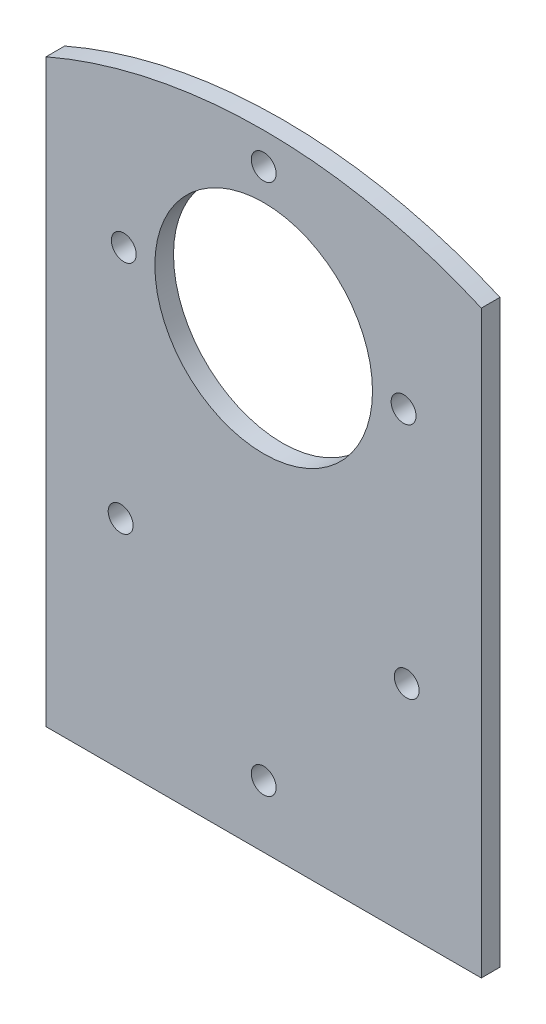
ISO-10303-21;
HEADER;
FILE_DESCRIPTION(('STEP AP214'),'2;1');
FILE_NAME('part.step','',(''),(''),'','','');
FILE_SCHEMA(('AUTOMOTIVE_DESIGN { 1 0 10303 214 1 1 1 1 }'));
ENDSEC;
DATA;
#1=APPLICATION_CONTEXT('core data for automotive mechanical design processes');
#2=APPLICATION_PROTOCOL_DEFINITION('international standard','automotive_design',2000,#1);
#3=PRODUCT_CONTEXT('',#1,'mechanical');
#4=PRODUCT('Part','Part','',(#3));
#5=PRODUCT_RELATED_PRODUCT_CATEGORY('part','',(#4));
#6=PRODUCT_DEFINITION_FORMATION('','',#4);
#7=PRODUCT_DEFINITION_CONTEXT('part definition',#1,'design');
#8=PRODUCT_DEFINITION('design','',#6,#7);
#9=PRODUCT_DEFINITION_SHAPE('','',#8);
#10=(LENGTH_UNIT() NAMED_UNIT(*) SI_UNIT(.MILLI.,.METRE.));
#11=(NAMED_UNIT(*) PLANE_ANGLE_UNIT() SI_UNIT($,.RADIAN.));
#12=(NAMED_UNIT(*) SI_UNIT($,.STERADIAN.) SOLID_ANGLE_UNIT());
#13=UNCERTAINTY_MEASURE_WITH_UNIT(LENGTH_MEASURE(1.E-05),#10,'distance_accuracy_value','');
#14=(GEOMETRIC_REPRESENTATION_CONTEXT(3) GLOBAL_UNCERTAINTY_ASSIGNED_CONTEXT((#13)) GLOBAL_UNIT_ASSIGNED_CONTEXT((#10,
#11,#12)) REPRESENTATION_CONTEXT('',''));
#15=CARTESIAN_POINT('',(0.,0.,0.));
#16=DIRECTION('',(0.,0.,1.));
#17=DIRECTION('',(1.,0.,0.));
#18=AXIS2_PLACEMENT_3D('',#15,#16,#17);
#19=CARTESIAN_POINT('',(-35.,-52.5,3.));
#20=DIRECTION('',(1.,0.,0.));
#21=DIRECTION('',(0.,0.,-1.));
#22=AXIS2_PLACEMENT_3D('',#19,#20,#21);
#23=PLANE('',#22);
#24=DIRECTION('',(0.,-1.,0.));
#25=VECTOR('',#24,1.);
#26=CARTESIAN_POINT('',(-35.,-52.5,3.));
#27=LINE('',#26,#25);
#28=CARTESIAN_POINT('',(-35.,40.7935435021813,3.));
#29=VERTEX_POINT('',#28);
#30=CARTESIAN_POINT('',(-35.,-52.5,3.));
#31=VERTEX_POINT('',#30);
#32=EDGE_CURVE('E88',#29,#31,#27,.T.);
#33=ORIENTED_EDGE('',*,*,#32,.F.);
#34=DIRECTION('',(0.,0.,1.));
#35=VECTOR('',#34,1.);
#36=CARTESIAN_POINT('',(-35.,40.7935435021813,-7.));
#37=LINE('',#36,#35);
#38=CARTESIAN_POINT('',(-35.,40.7935435021813,0.));
#39=VERTEX_POINT('',#38);
#40=EDGE_CURVE('E127',#39,#29,#37,.T.);
#41=ORIENTED_EDGE('',*,*,#40,.F.);
#42=DIRECTION('',(0.,-1.,0.));
#43=VECTOR('',#42,1.);
#44=CARTESIAN_POINT('',(-35.,-52.5,0.));
#45=LINE('',#44,#43);
#46=CARTESIAN_POINT('',(-35.,-52.5,0.));
#47=VERTEX_POINT('',#46);
#48=EDGE_CURVE('E80',#39,#47,#45,.T.);
#49=ORIENTED_EDGE('',*,*,#48,.T.);
#50=DIRECTION('',(0.,0.,-1.));
#51=VECTOR('',#50,1.);
#52=CARTESIAN_POINT('',(-35.,-52.5,3.));
#53=LINE('',#52,#51);
#54=EDGE_CURVE('E42',#31,#47,#53,.T.);
#55=ORIENTED_EDGE('',*,*,#54,.F.);
#56=EDGE_LOOP('',(#33,#41,#49,#55));
#57=FACE_BOUND('',#56,.T.);
#58=ADVANCED_FACE('F35',(#57),#23,.F.);
#59=CARTESIAN_POINT('',(35.,-52.5,3.));
#60=DIRECTION('',(0.,1.,0.));
#61=DIRECTION('',(-1.,0.,0.));
#62=AXIS2_PLACEMENT_3D('',#59,#60,#61);
#63=PLANE('',#62);
#64=DIRECTION('',(1.,0.,0.));
#65=VECTOR('',#64,1.);
#66=CARTESIAN_POINT('',(35.,-52.5,0.));
#67=LINE('',#66,#65);
#68=CARTESIAN_POINT('',(35.,-52.5,0.));
#69=VERTEX_POINT('',#68);
#70=EDGE_CURVE('E70',#47,#69,#67,.T.);
#71=ORIENTED_EDGE('',*,*,#70,.T.);
#72=DIRECTION('',(0.,0.,-1.));
#73=VECTOR('',#72,1.);
#74=CARTESIAN_POINT('',(35.,-52.5,3.));
#75=LINE('',#74,#73);
#76=CARTESIAN_POINT('',(35.,-52.5,3.));
#77=VERTEX_POINT('',#76);
#78=EDGE_CURVE('E73',#77,#69,#75,.T.);
#79=ORIENTED_EDGE('',*,*,#78,.F.);
#80=DIRECTION('',(1.,0.,0.));
#81=VECTOR('',#80,1.);
#82=CARTESIAN_POINT('',(35.,-52.5,3.));
#83=LINE('',#82,#81);
#84=EDGE_CURVE('E57',#31,#77,#83,.T.);
#85=ORIENTED_EDGE('',*,*,#84,.F.);
#86=ORIENTED_EDGE('',*,*,#54,.T.);
#87=EDGE_LOOP('',(#71,#79,#85,#86));
#88=FACE_BOUND('',#87,.T.);
#89=ADVANCED_FACE('F72',(#88),#63,.F.);
#90=CARTESIAN_POINT('',(35.,-52.5,3.));
#91=DIRECTION('',(-1.,0.,0.));
#92=DIRECTION('',(0.,0.,1.));
#93=AXIS2_PLACEMENT_3D('',#90,#91,#92);
#94=PLANE('',#93);
#95=DIRECTION('',(0.,1.,0.));
#96=VECTOR('',#95,1.);
#97=CARTESIAN_POINT('',(35.,-52.5,0.));
#98=LINE('',#97,#96);
#99=CARTESIAN_POINT('',(35.,40.7935435021813,0.));
#100=VERTEX_POINT('',#99);
#101=EDGE_CURVE('E79',#69,#100,#98,.T.);
#102=ORIENTED_EDGE('',*,*,#101,.T.);
#103=DIRECTION('',(0.,0.,1.));
#104=VECTOR('',#103,1.);
#105=CARTESIAN_POINT('',(35.,40.7935435021813,-7.));
#106=LINE('',#105,#104);
#107=CARTESIAN_POINT('',(35.,40.7935435021813,3.));
#108=VERTEX_POINT('',#107);
#109=EDGE_CURVE('E49',#100,#108,#106,.T.);
#110=ORIENTED_EDGE('',*,*,#109,.T.);
#111=DIRECTION('',(0.,1.,0.));
#112=VECTOR('',#111,1.);
#113=CARTESIAN_POINT('',(35.,-52.5,3.));
#114=LINE('',#113,#112);
#115=EDGE_CURVE('E85',#77,#108,#114,.T.);
#116=ORIENTED_EDGE('',*,*,#115,.F.);
#117=ORIENTED_EDGE('',*,*,#78,.T.);
#118=EDGE_LOOP('',(#102,#110,#116,#117));
#119=FACE_BOUND('',#118,.T.);
#120=ADVANCED_FACE('F84',(#119),#94,.F.);
#121=CARTESIAN_POINT('',(0.,0.,3.));
#122=DIRECTION('',(0.,0.,1.));
#123=DIRECTION('',(1.,0.,0.));
#124=AXIS2_PLACEMENT_3D('',#121,#122,#123);
#125=PLANE('',#124);
#126=CARTESIAN_POINT('',(0.,-39.6661412899121,3.));
#127=DIRECTION('',(0.,0.,-1.));
#128=DIRECTION('',(-1.,0.,0.));
#129=AXIS2_PLACEMENT_3D('',#126,#127,#128);
#130=CIRCLE('',#129,87.7425830303795);
#131=EDGE_CURVE('E133',#29,#108,#130,.T.);
#132=ORIENTED_EDGE('',*,*,#131,.F.);
#133=ORIENTED_EDGE('',*,*,#32,.T.);
#134=ORIENTED_EDGE('',*,*,#84,.T.);
#135=ORIENTED_EDGE('',*,*,#115,.T.);
#136=EDGE_LOOP('',(#132,#133,#134,#135));
#137=FACE_BOUND('',#136,.T.);
#138=CARTESIAN_POINT('',(0.,-42.5,3.));
#139=DIRECTION('',(0.,0.,1.));
#140=DIRECTION('',(1.,0.,0.));
#141=AXIS2_PLACEMENT_3D('',#138,#139,#140);
#142=CIRCLE('',#141,2.);
#143=CARTESIAN_POINT('',(2.00000000000002,-42.5,3.));
#144=VERTEX_POINT('',#143);
#145=EDGE_CURVE('E98',#144,#144,#142,.T.);
#146=ORIENTED_EDGE('',*,*,#145,.F.);
#147=EDGE_LOOP('',(#146));
#148=FACE_BOUND('',#147,.T.);
#149=CARTESIAN_POINT('',(-23.,-17.5,3.));
#150=DIRECTION('',(0.,0.,1.));
#151=DIRECTION('',(1.,0.,0.));
#152=AXIS2_PLACEMENT_3D('',#149,#150,#151);
#153=CIRCLE('',#152,2.00000000000001);
#154=CARTESIAN_POINT('',(-21.,-17.5,3.));
#155=VERTEX_POINT('',#154);
#156=EDGE_CURVE('E147',#155,#155,#153,.T.);
#157=ORIENTED_EDGE('',*,*,#156,.F.);
#158=EDGE_LOOP('',(#157));
#159=FACE_BOUND('',#158,.T.);
#160=CARTESIAN_POINT('',(23.,-17.5,3.));
#161=DIRECTION('',(0.,0.,1.));
#162=DIRECTION('',(-1.,0.,0.));
#163=AXIS2_PLACEMENT_3D('',#160,#161,#162);
#164=CIRCLE('',#163,2.00000000000001);
#165=CARTESIAN_POINT('',(21.,-17.5,3.));
#166=VERTEX_POINT('',#165);
#167=EDGE_CURVE('E151',#166,#166,#164,.T.);
#168=ORIENTED_EDGE('',*,*,#167,.F.);
#169=EDGE_LOOP('',(#168));
#170=FACE_BOUND('',#169,.T.);
#171=CARTESIAN_POINT('',(0.,43.,3.));
#172=DIRECTION('',(0.,0.,1.));
#173=DIRECTION('',(1.,0.,0.));
#174=AXIS2_PLACEMENT_3D('',#171,#172,#173);
#175=CIRCLE('',#174,2.);
#176=CARTESIAN_POINT('',(2.,43.,3.));
#177=VERTEX_POINT('',#176);
#178=EDGE_CURVE('E155',#177,#177,#175,.T.);
#179=ORIENTED_EDGE('',*,*,#178,.F.);
#180=EDGE_LOOP('',(#179));
#181=FACE_BOUND('',#180,.T.);
#182=CARTESIAN_POINT('',(-22.5,20.5,3.));
#183=DIRECTION('',(0.,0.,1.));
#184=DIRECTION('',(1.,0.,0.));
#185=AXIS2_PLACEMENT_3D('',#182,#183,#184);
#186=CIRCLE('',#185,2.);
#187=CARTESIAN_POINT('',(-20.5,20.5,3.));
#188=VERTEX_POINT('',#187);
#189=EDGE_CURVE('E159',#188,#188,#186,.T.);
#190=ORIENTED_EDGE('',*,*,#189,.F.);
#191=EDGE_LOOP('',(#190));
#192=FACE_BOUND('',#191,.T.);
#193=CARTESIAN_POINT('',(22.5,20.5,3.));
#194=DIRECTION('',(0.,0.,1.));
#195=DIRECTION('',(1.,0.,0.));
#196=AXIS2_PLACEMENT_3D('',#193,#194,#195);
#197=CIRCLE('',#196,2.);
#198=CARTESIAN_POINT('',(24.5,20.5,3.));
#199=VERTEX_POINT('',#198);
#200=EDGE_CURVE('E106',#199,#199,#197,.T.);
#201=ORIENTED_EDGE('',*,*,#200,.F.);
#202=EDGE_LOOP('',(#201));
#203=FACE_BOUND('',#202,.T.);
#204=CARTESIAN_POINT('',(0.,20.5,3.));
#205=DIRECTION('',(0.,0.,-1.));
#206=DIRECTION('',(-1.,0.,0.));
#207=AXIS2_PLACEMENT_3D('',#204,#205,#206);
#208=CIRCLE('',#207,17.5);
#209=CARTESIAN_POINT('',(-17.5,20.5,3.));
#210=VERTEX_POINT('',#209);
#211=EDGE_CURVE('E115',#210,#210,#208,.T.);
#212=ORIENTED_EDGE('',*,*,#211,.T.);
#213=EDGE_LOOP('',(#212));
#214=FACE_BOUND('',#213,.T.);
#215=ADVANCED_FACE('F137',(#137,#148,#159,#170,#181,#192,#203,#214),#125,.T.);
#216=CARTESIAN_POINT('',(0.,0.,0.));
#217=DIRECTION('',(0.,0.,1.));
#218=DIRECTION('',(1.,0.,0.));
#219=AXIS2_PLACEMENT_3D('',#216,#217,#218);
#220=PLANE('',#219);
#221=CARTESIAN_POINT('',(0.,-42.5,0.));
#222=DIRECTION('',(0.,0.,1.));
#223=DIRECTION('',(1.,0.,0.));
#224=AXIS2_PLACEMENT_3D('',#221,#222,#223);
#225=CIRCLE('',#224,2.);
#226=CARTESIAN_POINT('',(2.00000000000002,-42.5,0.));
#227=VERTEX_POINT('',#226);
#228=EDGE_CURVE('E100',#227,#227,#225,.T.);
#229=ORIENTED_EDGE('',*,*,#228,.T.);
#230=EDGE_LOOP('',(#229));
#231=FACE_BOUND('',#230,.T.);
#232=CARTESIAN_POINT('',(-23.,-17.5,0.));
#233=DIRECTION('',(0.,0.,1.));
#234=DIRECTION('',(1.,0.,0.));
#235=AXIS2_PLACEMENT_3D('',#232,#233,#234);
#236=CIRCLE('',#235,2.00000000000001);
#237=CARTESIAN_POINT('',(-21.,-17.5,0.));
#238=VERTEX_POINT('',#237);
#239=EDGE_CURVE('E97',#238,#238,#236,.T.);
#240=ORIENTED_EDGE('',*,*,#239,.T.);
#241=EDGE_LOOP('',(#240));
#242=FACE_BOUND('',#241,.T.);
#243=CARTESIAN_POINT('',(23.,-17.5,0.));
#244=DIRECTION('',(0.,0.,1.));
#245=DIRECTION('',(1.,0.,0.));
#246=AXIS2_PLACEMENT_3D('',#243,#244,#245);
#247=CIRCLE('',#246,2.00000000000001);
#248=CARTESIAN_POINT('',(25.,-17.5,0.));
#249=VERTEX_POINT('',#248);
#250=EDGE_CURVE('E94',#249,#249,#247,.T.);
#251=ORIENTED_EDGE('',*,*,#250,.T.);
#252=EDGE_LOOP('',(#251));
#253=FACE_BOUND('',#252,.T.);
#254=CARTESIAN_POINT('',(0.,43.,0.));
#255=DIRECTION('',(0.,0.,1.));
#256=DIRECTION('',(1.,0.,0.));
#257=AXIS2_PLACEMENT_3D('',#254,#255,#256);
#258=CIRCLE('',#257,2.);
#259=CARTESIAN_POINT('',(2.,43.,0.));
#260=VERTEX_POINT('',#259);
#261=EDGE_CURVE('E120',#260,#260,#258,.T.);
#262=ORIENTED_EDGE('',*,*,#261,.T.);
#263=EDGE_LOOP('',(#262));
#264=FACE_BOUND('',#263,.T.);
#265=CARTESIAN_POINT('',(-22.5,20.5,0.));
#266=DIRECTION('',(0.,0.,1.));
#267=DIRECTION('',(1.,0.,0.));
#268=AXIS2_PLACEMENT_3D('',#265,#266,#267);
#269=CIRCLE('',#268,2.);
#270=CARTESIAN_POINT('',(-20.5,20.5,0.));
#271=VERTEX_POINT('',#270);
#272=EDGE_CURVE('E111',#271,#271,#269,.T.);
#273=ORIENTED_EDGE('',*,*,#272,.T.);
#274=EDGE_LOOP('',(#273));
#275=FACE_BOUND('',#274,.T.);
#276=CARTESIAN_POINT('',(22.5,20.5,0.));
#277=DIRECTION('',(0.,0.,1.));
#278=DIRECTION('',(1.,0.,0.));
#279=AXIS2_PLACEMENT_3D('',#276,#277,#278);
#280=CIRCLE('',#279,2.);
#281=CARTESIAN_POINT('',(24.5,20.5,0.));
#282=VERTEX_POINT('',#281);
#283=EDGE_CURVE('E102',#282,#282,#280,.T.);
#284=ORIENTED_EDGE('',*,*,#283,.T.);
#285=EDGE_LOOP('',(#284));
#286=FACE_BOUND('',#285,.T.);
#287=CARTESIAN_POINT('',(0.,20.5,0.));
#288=DIRECTION('',(0.,0.,-1.));
#289=DIRECTION('',(-1.,0.,0.));
#290=AXIS2_PLACEMENT_3D('',#287,#288,#289);
#291=CIRCLE('',#290,17.5);
#292=CARTESIAN_POINT('',(-17.5,20.5,0.));
#293=VERTEX_POINT('',#292);
#294=EDGE_CURVE('E118',#293,#293,#291,.T.);
#295=ORIENTED_EDGE('',*,*,#294,.F.);
#296=EDGE_LOOP('',(#295));
#297=FACE_BOUND('',#296,.T.);
#298=ORIENTED_EDGE('',*,*,#48,.F.);
#299=CARTESIAN_POINT('',(0.,-39.6661412899121,0.));
#300=DIRECTION('',(0.,0.,1.));
#301=DIRECTION('',(1.,0.,0.));
#302=AXIS2_PLACEMENT_3D('',#299,#300,#301);
#303=CIRCLE('',#302,87.7425830303795);
#304=EDGE_CURVE('E11',#39,#100,#303,.F.);
#305=ORIENTED_EDGE('',*,*,#304,.T.);
#306=ORIENTED_EDGE('',*,*,#101,.F.);
#307=ORIENTED_EDGE('',*,*,#70,.F.);
#308=EDGE_LOOP('',(#298,#305,#306,#307));
#309=FACE_BOUND('',#308,.T.);
#310=ADVANCED_FACE('F87',(#231,#242,#253,#264,#275,#286,#297,#309),#220,.F.);
#311=CARTESIAN_POINT('',(0.,20.5,3.));
#312=DIRECTION('',(0.,0.,-1.));
#313=DIRECTION('',(-1.,0.,0.));
#314=AXIS2_PLACEMENT_3D('',#311,#312,#313);
#315=CYLINDRICAL_SURFACE('',#314,17.5);
#316=ORIENTED_EDGE('',*,*,#211,.F.);
#317=EDGE_LOOP('',(#316));
#318=FACE_BOUND('',#317,.T.);
#319=ORIENTED_EDGE('',*,*,#294,.T.);
#320=EDGE_LOOP('',(#319));
#321=FACE_BOUND('',#320,.T.);
#322=ADVANCED_FACE('F164',(#318,#321),#315,.F.);
#323=CARTESIAN_POINT('',(22.5,20.5,0.));
#324=DIRECTION('',(0.,0.,1.));
#325=DIRECTION('',(1.,0.,0.));
#326=AXIS2_PLACEMENT_3D('',#323,#324,#325);
#327=CYLINDRICAL_SURFACE('',#326,2.);
#328=ORIENTED_EDGE('',*,*,#283,.F.);
#329=EDGE_LOOP('',(#328));
#330=FACE_BOUND('',#329,.T.);
#331=ORIENTED_EDGE('',*,*,#200,.T.);
#332=EDGE_LOOP('',(#331));
#333=FACE_BOUND('',#332,.T.);
#334=ADVANCED_FACE('F167',(#330,#333),#327,.F.);
#335=CARTESIAN_POINT('',(-22.5,20.5,0.));
#336=DIRECTION('',(0.,0.,1.));
#337=DIRECTION('',(1.,0.,0.));
#338=AXIS2_PLACEMENT_3D('',#335,#336,#337);
#339=CYLINDRICAL_SURFACE('',#338,2.);
#340=ORIENTED_EDGE('',*,*,#272,.F.);
#341=EDGE_LOOP('',(#340));
#342=FACE_BOUND('',#341,.T.);
#343=ORIENTED_EDGE('',*,*,#189,.T.);
#344=EDGE_LOOP('',(#343));
#345=FACE_BOUND('',#344,.T.);
#346=ADVANCED_FACE('F236',(#342,#345),#339,.F.);
#347=CARTESIAN_POINT('',(0.,43.,0.));
#348=DIRECTION('',(0.,0.,1.));
#349=DIRECTION('',(1.,0.,0.));
#350=AXIS2_PLACEMENT_3D('',#347,#348,#349);
#351=CYLINDRICAL_SURFACE('',#350,2.);
#352=ORIENTED_EDGE('',*,*,#261,.F.);
#353=EDGE_LOOP('',(#352));
#354=FACE_BOUND('',#353,.T.);
#355=ORIENTED_EDGE('',*,*,#178,.T.);
#356=EDGE_LOOP('',(#355));
#357=FACE_BOUND('',#356,.T.);
#358=ADVANCED_FACE('F228',(#354,#357),#351,.F.);
#359=CARTESIAN_POINT('',(23.,-17.5,-2.));
#360=DIRECTION('',(0.,0.,1.));
#361=DIRECTION('',(1.,0.,0.));
#362=AXIS2_PLACEMENT_3D('',#359,#360,#361);
#363=CYLINDRICAL_SURFACE('',#362,2.00000000000001);
#364=ORIENTED_EDGE('',*,*,#167,.T.);
#365=EDGE_LOOP('',(#364));
#366=FACE_BOUND('',#365,.T.);
#367=ORIENTED_EDGE('',*,*,#250,.F.);
#368=EDGE_LOOP('',(#367));
#369=FACE_BOUND('',#368,.T.);
#370=ADVANCED_FACE('F220',(#366,#369),#363,.F.);
#371=CARTESIAN_POINT('',(-23.,-17.5,-2.));
#372=DIRECTION('',(0.,0.,1.));
#373=DIRECTION('',(1.,0.,0.));
#374=AXIS2_PLACEMENT_3D('',#371,#372,#373);
#375=CYLINDRICAL_SURFACE('',#374,2.00000000000001);
#376=ORIENTED_EDGE('',*,*,#156,.T.);
#377=EDGE_LOOP('',(#376));
#378=FACE_BOUND('',#377,.T.);
#379=ORIENTED_EDGE('',*,*,#239,.F.);
#380=EDGE_LOOP('',(#379));
#381=FACE_BOUND('',#380,.T.);
#382=ADVANCED_FACE('F213',(#378,#381),#375,.F.);
#383=CARTESIAN_POINT('',(0.,-42.5,-2.));
#384=DIRECTION('',(0.,0.,1.));
#385=DIRECTION('',(1.,0.,0.));
#386=AXIS2_PLACEMENT_3D('',#383,#384,#385);
#387=CYLINDRICAL_SURFACE('',#386,2.);
#388=ORIENTED_EDGE('',*,*,#145,.T.);
#389=EDGE_LOOP('',(#388));
#390=FACE_BOUND('',#389,.T.);
#391=ORIENTED_EDGE('',*,*,#228,.F.);
#392=EDGE_LOOP('',(#391));
#393=FACE_BOUND('',#392,.T.);
#394=ADVANCED_FACE('F203',(#390,#393),#387,.F.);
#395=CARTESIAN_POINT('',(0.,-39.6661412899121,-7.));
#396=DIRECTION('',(0.,0.,1.));
#397=DIRECTION('',(1.,0.,0.));
#398=AXIS2_PLACEMENT_3D('',#395,#396,#397);
#399=CYLINDRICAL_SURFACE('',#398,87.7425830303795);
#400=ORIENTED_EDGE('',*,*,#40,.T.);
#401=ORIENTED_EDGE('',*,*,#131,.T.);
#402=ORIENTED_EDGE('',*,*,#109,.F.);
#403=ORIENTED_EDGE('',*,*,#304,.F.);
#404=EDGE_LOOP('',(#400,#401,#402,#403));
#405=FACE_BOUND('',#404,.T.);
#406=ADVANCED_FACE('F134',(#405),#399,.T.);
#407=CLOSED_SHELL('',(#58,#89,#120,#215,#310,#322,#334,#346,#358,#370,#382,#394,#406));
#408=MANIFOLD_SOLID_BREP('B2',#407);
#409=ADVANCED_BREP_SHAPE_REPRESENTATION('',(#18,#408),#14);
#410=SHAPE_DEFINITION_REPRESENTATION(#9,#409);
ENDSEC;
END-ISO-10303-21;
